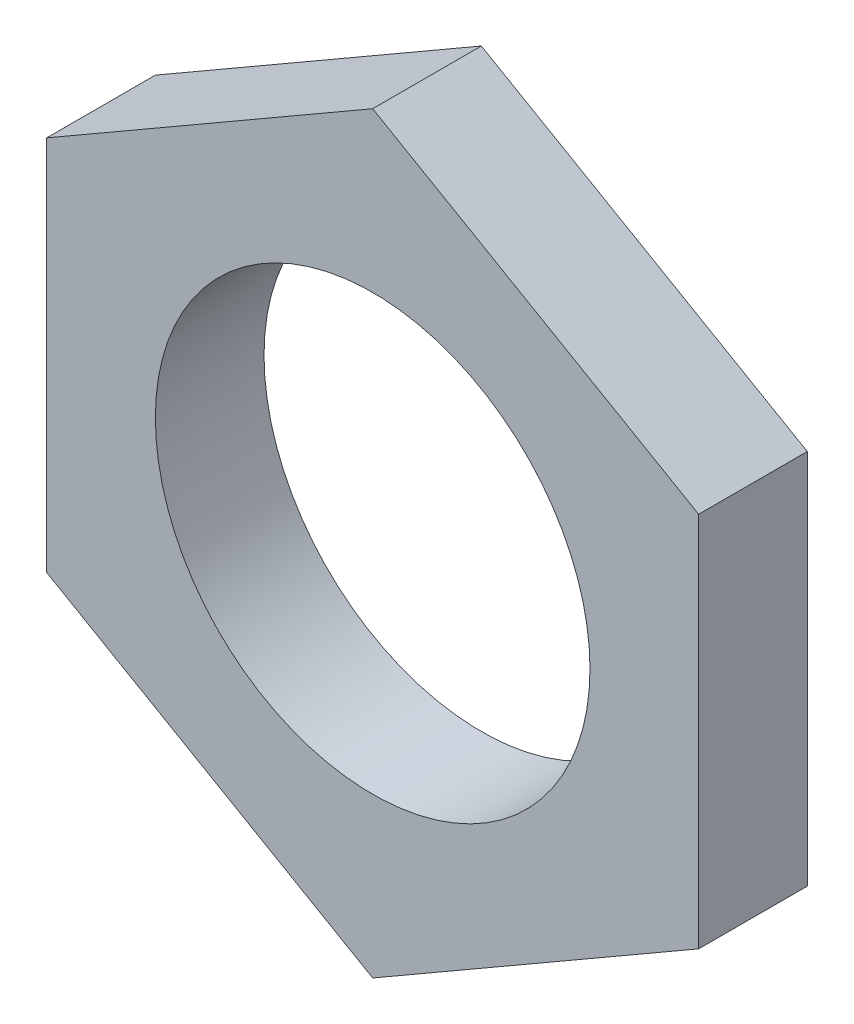
ISO-10303-21;
HEADER;
FILE_DESCRIPTION(('STEP AP214'),'2;1');
FILE_NAME('part.step','',(''),(''),'','','');
FILE_SCHEMA(('AUTOMOTIVE_DESIGN { 1 0 10303 214 1 1 1 1 }'));
ENDSEC;
DATA;
#1=APPLICATION_CONTEXT('core data for automotive mechanical design processes');
#2=APPLICATION_PROTOCOL_DEFINITION('international standard','automotive_design',2000,#1);
#3=PRODUCT_CONTEXT('',#1,'mechanical');
#4=PRODUCT('Part','Part','',(#3));
#5=PRODUCT_RELATED_PRODUCT_CATEGORY('part','',(#4));
#6=PRODUCT_DEFINITION_FORMATION('','',#4);
#7=PRODUCT_DEFINITION_CONTEXT('part definition',#1,'design');
#8=PRODUCT_DEFINITION('design','',#6,#7);
#9=PRODUCT_DEFINITION_SHAPE('','',#8);
#10=(LENGTH_UNIT() NAMED_UNIT(*) SI_UNIT(.MILLI.,.METRE.));
#11=(NAMED_UNIT(*) PLANE_ANGLE_UNIT() SI_UNIT($,.RADIAN.));
#12=(NAMED_UNIT(*) SI_UNIT($,.STERADIAN.) SOLID_ANGLE_UNIT());
#13=UNCERTAINTY_MEASURE_WITH_UNIT(LENGTH_MEASURE(1.E-05),#10,'distance_accuracy_value','');
#14=(GEOMETRIC_REPRESENTATION_CONTEXT(3) GLOBAL_UNCERTAINTY_ASSIGNED_CONTEXT((#13)) GLOBAL_UNIT_ASSIGNED_CONTEXT((#10,
#11,#12)) REPRESENTATION_CONTEXT('',''));
#15=CARTESIAN_POINT('',(0.,0.,0.));
#16=DIRECTION('',(0.,0.,1.));
#17=DIRECTION('',(1.,0.,0.));
#18=AXIS2_PLACEMENT_3D('',#15,#16,#17);
#19=CARTESIAN_POINT('',(0.,0.,2.));
#20=DIRECTION('',(0.,0.,1.));
#21=DIRECTION('',(1.,0.,0.));
#22=AXIS2_PLACEMENT_3D('',#19,#20,#21);
#23=PLANE('',#22);
#24=DIRECTION('',(-0.866025403784439,0.5,0.));
#25=VECTOR('',#24,1.);
#26=CARTESIAN_POINT('',(6.,3.46410161513776,2.));
#27=LINE('',#26,#25);
#28=CARTESIAN_POINT('',(6.,3.46410161513776,2.));
#29=VERTEX_POINT('',#28);
#30=CARTESIAN_POINT('',(0.,6.92820323027551,2.));
#31=VERTEX_POINT('',#30);
#32=EDGE_CURVE('E130',#29,#31,#27,.T.);
#33=ORIENTED_EDGE('',*,*,#32,.T.);
#34=DIRECTION('',(-0.866025403784439,-0.5,0.));
#35=VECTOR('',#34,1.);
#36=CARTESIAN_POINT('',(0.,6.92820323027551,2.));
#37=LINE('',#36,#35);
#38=CARTESIAN_POINT('',(-6.,3.46410161513776,2.));
#39=VERTEX_POINT('',#38);
#40=EDGE_CURVE('E88',#31,#39,#37,.T.);
#41=ORIENTED_EDGE('',*,*,#40,.T.);
#42=DIRECTION('',(0.,-1.,0.));
#43=VECTOR('',#42,1.);
#44=CARTESIAN_POINT('',(-6.,3.46410161513776,2.));
#45=LINE('',#44,#43);
#46=CARTESIAN_POINT('',(-6.,-3.46410161513775,2.));
#47=VERTEX_POINT('',#46);
#48=EDGE_CURVE('E101',#39,#47,#45,.T.);
#49=ORIENTED_EDGE('',*,*,#48,.T.);
#50=DIRECTION('',(0.866025403784439,-0.5,0.));
#51=VECTOR('',#50,1.);
#52=CARTESIAN_POINT('',(-6.,-3.46410161513775,2.));
#53=LINE('',#52,#51);
#54=CARTESIAN_POINT('',(0.,-6.92820323027551,2.));
#55=VERTEX_POINT('',#54);
#56=EDGE_CURVE('E95',#47,#55,#53,.T.);
#57=ORIENTED_EDGE('',*,*,#56,.T.);
#58=DIRECTION('',(0.866025403784439,0.5,0.));
#59=VECTOR('',#58,1.);
#60=CARTESIAN_POINT('',(0.,-6.92820323027551,2.));
#61=LINE('',#60,#59);
#62=CARTESIAN_POINT('',(6.,-3.46410161513776,2.));
#63=VERTEX_POINT('',#62);
#64=EDGE_CURVE('E99',#55,#63,#61,.T.);
#65=ORIENTED_EDGE('',*,*,#64,.T.);
#66=DIRECTION('',(0.,1.,0.));
#67=VECTOR('',#66,1.);
#68=CARTESIAN_POINT('',(6.,-3.46410161513776,2.));
#69=LINE('',#68,#67);
#70=EDGE_CURVE('E51',#63,#29,#69,.T.);
#71=ORIENTED_EDGE('',*,*,#70,.T.);
#72=EDGE_LOOP('',(#33,#41,#49,#57,#65,#71));
#73=FACE_BOUND('',#72,.T.);
#74=CARTESIAN_POINT('',(0.,0.,2.));
#75=DIRECTION('',(0.,0.,1.));
#76=DIRECTION('',(1.,0.,0.));
#77=AXIS2_PLACEMENT_3D('',#74,#75,#76);
#78=CIRCLE('',#77,4.);
#79=CARTESIAN_POINT('',(4.,0.,2.));
#80=VERTEX_POINT('',#79);
#81=EDGE_CURVE('E123',#80,#80,#78,.T.);
#82=ORIENTED_EDGE('',*,*,#81,.F.);
#83=EDGE_LOOP('',(#82));
#84=FACE_BOUND('',#83,.T.);
#85=ADVANCED_FACE('F34',(#73,#84),#23,.T.);
#86=CARTESIAN_POINT('',(0.,0.,0.));
#87=DIRECTION('',(0.,0.,1.));
#88=DIRECTION('',(1.,0.,0.));
#89=AXIS2_PLACEMENT_3D('',#86,#87,#88);
#90=PLANE('',#89);
#91=DIRECTION('',(-0.866025403784439,0.5,0.));
#92=VECTOR('',#91,1.);
#93=CARTESIAN_POINT('',(6.,3.46410161513776,0.));
#94=LINE('',#93,#92);
#95=CARTESIAN_POINT('',(6.,3.46410161513776,0.));
#96=VERTEX_POINT('',#95);
#97=CARTESIAN_POINT('',(0.,6.92820323027551,0.));
#98=VERTEX_POINT('',#97);
#99=EDGE_CURVE('E119',#96,#98,#94,.T.);
#100=ORIENTED_EDGE('',*,*,#99,.F.);
#101=DIRECTION('',(0.,1.,0.));
#102=VECTOR('',#101,1.);
#103=CARTESIAN_POINT('',(6.,-3.46410161513776,0.));
#104=LINE('',#103,#102);
#105=CARTESIAN_POINT('',(6.,-3.46410161513776,0.));
#106=VERTEX_POINT('',#105);
#107=EDGE_CURVE('E80',#106,#96,#104,.T.);
#108=ORIENTED_EDGE('',*,*,#107,.F.);
#109=DIRECTION('',(0.866025403784439,0.5,0.));
#110=VECTOR('',#109,1.);
#111=CARTESIAN_POINT('',(0.,-6.92820323027551,0.));
#112=LINE('',#111,#110);
#113=CARTESIAN_POINT('',(0.,-6.92820323027551,0.));
#114=VERTEX_POINT('',#113);
#115=EDGE_CURVE('E74',#114,#106,#112,.T.);
#116=ORIENTED_EDGE('',*,*,#115,.F.);
#117=DIRECTION('',(0.866025403784439,-0.5,0.));
#118=VECTOR('',#117,1.);
#119=CARTESIAN_POINT('',(-6.,-3.46410161513775,0.));
#120=LINE('',#119,#118);
#121=CARTESIAN_POINT('',(-6.,-3.46410161513775,0.));
#122=VERTEX_POINT('',#121);
#123=EDGE_CURVE('E109',#122,#114,#120,.T.);
#124=ORIENTED_EDGE('',*,*,#123,.F.);
#125=DIRECTION('',(0.,-1.,0.));
#126=VECTOR('',#125,1.);
#127=CARTESIAN_POINT('',(-6.,3.46410161513776,0.));
#128=LINE('',#127,#126);
#129=CARTESIAN_POINT('',(-6.,3.46410161513776,0.));
#130=VERTEX_POINT('',#129);
#131=EDGE_CURVE('E125',#130,#122,#128,.T.);
#132=ORIENTED_EDGE('',*,*,#131,.F.);
#133=DIRECTION('',(-0.866025403784439,-0.5,0.));
#134=VECTOR('',#133,1.);
#135=CARTESIAN_POINT('',(0.,6.92820323027551,0.));
#136=LINE('',#135,#134);
#137=EDGE_CURVE('E122',#98,#130,#136,.T.);
#138=ORIENTED_EDGE('',*,*,#137,.F.);
#139=EDGE_LOOP('',(#100,#108,#116,#124,#132,#138));
#140=FACE_BOUND('',#139,.T.);
#141=CARTESIAN_POINT('',(0.,0.,0.));
#142=DIRECTION('',(0.,0.,1.));
#143=DIRECTION('',(1.,0.,0.));
#144=AXIS2_PLACEMENT_3D('',#141,#142,#143);
#145=CIRCLE('',#144,4.);
#146=CARTESIAN_POINT('',(4.,0.,0.));
#147=VERTEX_POINT('',#146);
#148=EDGE_CURVE('E223',#147,#147,#145,.T.);
#149=ORIENTED_EDGE('',*,*,#148,.T.);
#150=EDGE_LOOP('',(#149));
#151=FACE_BOUND('',#150,.T.);
#152=ADVANCED_FACE('F139',(#140,#151),#90,.F.);
#153=CARTESIAN_POINT('',(6.,3.46410161513776,2.));
#154=DIRECTION('',(-0.5,-0.866025403784439,0.));
#155=DIRECTION('',(0.866025403784439,-0.5,0.));
#156=AXIS2_PLACEMENT_3D('',#153,#154,#155);
#157=PLANE('',#156);
#158=ORIENTED_EDGE('',*,*,#99,.T.);
#159=DIRECTION('',(0.,0.,-1.));
#160=VECTOR('',#159,1.);
#161=CARTESIAN_POINT('',(0.,6.92820323027551,2.));
#162=LINE('',#161,#160);
#163=EDGE_CURVE('E11',#31,#98,#162,.T.);
#164=ORIENTED_EDGE('',*,*,#163,.F.);
#165=ORIENTED_EDGE('',*,*,#32,.F.);
#166=DIRECTION('',(0.,0.,-1.));
#167=VECTOR('',#166,1.);
#168=CARTESIAN_POINT('',(6.,3.46410161513776,2.));
#169=LINE('',#168,#167);
#170=EDGE_CURVE('E115',#29,#96,#169,.T.);
#171=ORIENTED_EDGE('',*,*,#170,.T.);
#172=EDGE_LOOP('',(#158,#164,#165,#171));
#173=FACE_BOUND('',#172,.T.);
#174=ADVANCED_FACE('F36',(#173),#157,.F.);
#175=CARTESIAN_POINT('',(0.,6.92820323027551,2.));
#176=DIRECTION('',(0.5,-0.866025403784439,0.));
#177=DIRECTION('',(0.866025403784439,0.5,0.));
#178=AXIS2_PLACEMENT_3D('',#175,#176,#177);
#179=PLANE('',#178);
#180=ORIENTED_EDGE('',*,*,#137,.T.);
#181=DIRECTION('',(0.,0.,-1.));
#182=VECTOR('',#181,1.);
#183=CARTESIAN_POINT('',(-6.,3.46410161513776,2.));
#184=LINE('',#183,#182);
#185=EDGE_CURVE('E43',#39,#130,#184,.T.);
#186=ORIENTED_EDGE('',*,*,#185,.F.);
#187=ORIENTED_EDGE('',*,*,#40,.F.);
#188=ORIENTED_EDGE('',*,*,#163,.T.);
#189=EDGE_LOOP('',(#180,#186,#187,#188));
#190=FACE_BOUND('',#189,.T.);
#191=ADVANCED_FACE('F164',(#190),#179,.F.);
#192=CARTESIAN_POINT('',(-6.,3.46410161513776,2.));
#193=DIRECTION('',(1.,0.,0.));
#194=DIRECTION('',(0.,1.,0.));
#195=AXIS2_PLACEMENT_3D('',#192,#193,#194);
#196=PLANE('',#195);
#197=ORIENTED_EDGE('',*,*,#131,.T.);
#198=DIRECTION('',(0.,0.,-1.));
#199=VECTOR('',#198,1.);
#200=CARTESIAN_POINT('',(-6.,-3.46410161513775,2.));
#201=LINE('',#200,#199);
#202=EDGE_CURVE('E110',#47,#122,#201,.T.);
#203=ORIENTED_EDGE('',*,*,#202,.F.);
#204=ORIENTED_EDGE('',*,*,#48,.F.);
#205=ORIENTED_EDGE('',*,*,#185,.T.);
#206=EDGE_LOOP('',(#197,#203,#204,#205));
#207=FACE_BOUND('',#206,.T.);
#208=ADVANCED_FACE('F136',(#207),#196,.F.);
#209=CARTESIAN_POINT('',(-6.,-3.46410161513775,2.));
#210=DIRECTION('',(0.5,0.866025403784439,0.));
#211=DIRECTION('',(-0.866025403784439,0.5,0.));
#212=AXIS2_PLACEMENT_3D('',#209,#210,#211);
#213=PLANE('',#212);
#214=ORIENTED_EDGE('',*,*,#123,.T.);
#215=DIRECTION('',(0.,0.,-1.));
#216=VECTOR('',#215,1.);
#217=CARTESIAN_POINT('',(0.,-6.92820323027551,2.));
#218=LINE('',#217,#216);
#219=EDGE_CURVE('E106',#55,#114,#218,.T.);
#220=ORIENTED_EDGE('',*,*,#219,.F.);
#221=ORIENTED_EDGE('',*,*,#56,.F.);
#222=ORIENTED_EDGE('',*,*,#202,.T.);
#223=EDGE_LOOP('',(#214,#220,#221,#222));
#224=FACE_BOUND('',#223,.T.);
#225=ADVANCED_FACE('F107',(#224),#213,.F.);
#226=CARTESIAN_POINT('',(0.,-6.92820323027551,2.));
#227=DIRECTION('',(-0.5,0.866025403784439,0.));
#228=DIRECTION('',(-0.866025403784439,-0.5,0.));
#229=AXIS2_PLACEMENT_3D('',#226,#227,#228);
#230=PLANE('',#229);
#231=ORIENTED_EDGE('',*,*,#115,.T.);
#232=DIRECTION('',(0.,0.,-1.));
#233=VECTOR('',#232,1.);
#234=CARTESIAN_POINT('',(6.,-3.46410161513776,2.));
#235=LINE('',#234,#233);
#236=EDGE_CURVE('E111',#63,#106,#235,.T.);
#237=ORIENTED_EDGE('',*,*,#236,.F.);
#238=ORIENTED_EDGE('',*,*,#64,.F.);
#239=ORIENTED_EDGE('',*,*,#219,.T.);
#240=EDGE_LOOP('',(#231,#237,#238,#239));
#241=FACE_BOUND('',#240,.T.);
#242=ADVANCED_FACE('F113',(#241),#230,.F.);
#243=CARTESIAN_POINT('',(6.,-3.46410161513776,2.));
#244=DIRECTION('',(-1.,0.,0.));
#245=DIRECTION('',(0.,0.,1.));
#246=AXIS2_PLACEMENT_3D('',#243,#244,#245);
#247=PLANE('',#246);
#248=ORIENTED_EDGE('',*,*,#107,.T.);
#249=ORIENTED_EDGE('',*,*,#170,.F.);
#250=ORIENTED_EDGE('',*,*,#70,.F.);
#251=ORIENTED_EDGE('',*,*,#236,.T.);
#252=EDGE_LOOP('',(#248,#249,#250,#251));
#253=FACE_BOUND('',#252,.T.);
#254=ADVANCED_FACE('F144',(#253),#247,.F.);
#255=CARTESIAN_POINT('',(0.,0.,2.));
#256=DIRECTION('',(0.,0.,-1.));
#257=DIRECTION('',(-1.,0.,0.));
#258=AXIS2_PLACEMENT_3D('',#255,#256,#257);
#259=CYLINDRICAL_SURFACE('',#258,4.);
#260=ORIENTED_EDGE('',*,*,#81,.T.);
#261=EDGE_LOOP('',(#260));
#262=FACE_BOUND('',#261,.T.);
#263=ORIENTED_EDGE('',*,*,#148,.F.);
#264=EDGE_LOOP('',(#263));
#265=FACE_BOUND('',#264,.T.);
#266=ADVANCED_FACE('F146',(#262,#265),#259,.F.);
#267=CLOSED_SHELL('',(#85,#152,#174,#191,#208,#225,#242,#254,#266));
#268=MANIFOLD_SOLID_BREP('B2',#267);
#269=ADVANCED_BREP_SHAPE_REPRESENTATION('',(#18,#268),#14);
#270=SHAPE_DEFINITION_REPRESENTATION(#9,#269);
ENDSEC;
END-ISO-10303-21;
